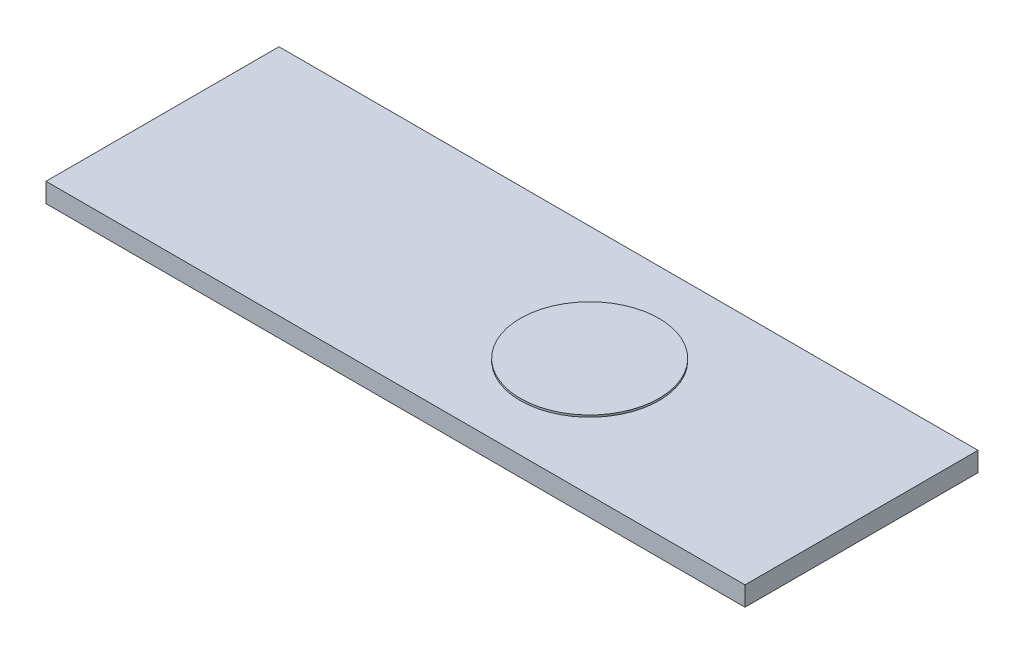
ISO-10303-21;
HEADER;
FILE_DESCRIPTION(('STEP AP214'),'2;1');
FILE_NAME('part.step','',(''),(''),'','','');
FILE_SCHEMA(('AUTOMOTIVE_DESIGN { 1 0 10303 214 1 1 1 1 }'));
ENDSEC;
DATA;
#1=APPLICATION_CONTEXT('core data for automotive mechanical design processes');
#2=APPLICATION_PROTOCOL_DEFINITION('international standard','automotive_design',2000,#1);
#3=PRODUCT_CONTEXT('',#1,'mechanical');
#4=PRODUCT('Part','Part','',(#3));
#5=PRODUCT_RELATED_PRODUCT_CATEGORY('part','',(#4));
#6=PRODUCT_DEFINITION_FORMATION('','',#4);
#7=PRODUCT_DEFINITION_CONTEXT('part definition',#1,'design');
#8=PRODUCT_DEFINITION('design','',#6,#7);
#9=PRODUCT_DEFINITION_SHAPE('','',#8);
#10=(LENGTH_UNIT() NAMED_UNIT(*) SI_UNIT(.MILLI.,.METRE.));
#11=(NAMED_UNIT(*) PLANE_ANGLE_UNIT() SI_UNIT($,.RADIAN.));
#12=(NAMED_UNIT(*) SI_UNIT($,.STERADIAN.) SOLID_ANGLE_UNIT());
#13=UNCERTAINTY_MEASURE_WITH_UNIT(LENGTH_MEASURE(1.E-05),#10,'distance_accuracy_value','');
#14=(GEOMETRIC_REPRESENTATION_CONTEXT(3) GLOBAL_UNCERTAINTY_ASSIGNED_CONTEXT((#13)) GLOBAL_UNIT_ASSIGNED_CONTEXT((#10,
#11,#12)) REPRESENTATION_CONTEXT('',''));
#15=CARTESIAN_POINT('',(0.,0.,0.));
#16=DIRECTION('',(0.,0.,1.));
#17=DIRECTION('',(1.,0.,0.));
#18=AXIS2_PLACEMENT_3D('',#15,#16,#17);
#19=CARTESIAN_POINT('',(-18.,1.,6.));
#20=DIRECTION('',(1.,0.,0.));
#21=DIRECTION('',(0.,0.,-1.));
#22=AXIS2_PLACEMENT_3D('',#19,#20,#21);
#23=PLANE('',#22);
#24=DIRECTION('',(0.,0.,1.));
#25=VECTOR('',#24,1.);
#26=CARTESIAN_POINT('',(-18.,0.,6.));
#27=LINE('',#26,#25);
#28=CARTESIAN_POINT('',(-18.,0.,-6.));
#29=VERTEX_POINT('',#28);
#30=CARTESIAN_POINT('',(-18.,0.,6.));
#31=VERTEX_POINT('',#30);
#32=EDGE_CURVE('E116',#29,#31,#27,.T.);
#33=ORIENTED_EDGE('',*,*,#32,.T.);
#34=DIRECTION('',(0.,-1.,0.));
#35=VECTOR('',#34,1.);
#36=CARTESIAN_POINT('',(-18.,1.,6.));
#37=LINE('',#36,#35);
#38=CARTESIAN_POINT('',(-18.,1.,6.));
#39=VERTEX_POINT('',#38);
#40=EDGE_CURVE('E48',#39,#31,#37,.T.);
#41=ORIENTED_EDGE('',*,*,#40,.F.);
#42=DIRECTION('',(0.,0.,1.));
#43=VECTOR('',#42,1.);
#44=CARTESIAN_POINT('',(-18.,1.,6.));
#45=LINE('',#44,#43);
#46=CARTESIAN_POINT('',(-18.,1.,-6.));
#47=VERTEX_POINT('',#46);
#48=EDGE_CURVE('E99',#47,#39,#45,.T.);
#49=ORIENTED_EDGE('',*,*,#48,.F.);
#50=DIRECTION('',(0.,-1.,0.));
#51=VECTOR('',#50,1.);
#52=CARTESIAN_POINT('',(-18.,1.,-6.));
#53=LINE('',#52,#51);
#54=EDGE_CURVE('E112',#47,#29,#53,.T.);
#55=ORIENTED_EDGE('',*,*,#54,.T.);
#56=EDGE_LOOP('',(#33,#41,#49,#55));
#57=FACE_BOUND('',#56,.T.);
#58=ADVANCED_FACE('F45',(#57),#23,.F.);
#59=CARTESIAN_POINT('',(18.,1.,6.));
#60=DIRECTION('',(0.,0.,-1.));
#61=DIRECTION('',(-1.,0.,0.));
#62=AXIS2_PLACEMENT_3D('',#59,#60,#61);
#63=PLANE('',#62);
#64=DIRECTION('',(1.,0.,0.));
#65=VECTOR('',#64,1.);
#66=CARTESIAN_POINT('',(18.,0.,6.));
#67=LINE('',#66,#65);
#68=CARTESIAN_POINT('',(18.,0.,6.));
#69=VERTEX_POINT('',#68);
#70=EDGE_CURVE('E105',#31,#69,#67,.T.);
#71=ORIENTED_EDGE('',*,*,#70,.T.);
#72=DIRECTION('',(0.,-1.,0.));
#73=VECTOR('',#72,1.);
#74=CARTESIAN_POINT('',(18.,1.,6.));
#75=LINE('',#74,#73);
#76=CARTESIAN_POINT('',(18.,1.,6.));
#77=VERTEX_POINT('',#76);
#78=EDGE_CURVE('E103',#77,#69,#75,.T.);
#79=ORIENTED_EDGE('',*,*,#78,.F.);
#80=DIRECTION('',(1.,0.,0.));
#81=VECTOR('',#80,1.);
#82=CARTESIAN_POINT('',(18.,1.,6.));
#83=LINE('',#82,#81);
#84=EDGE_CURVE('E94',#39,#77,#83,.T.);
#85=ORIENTED_EDGE('',*,*,#84,.F.);
#86=ORIENTED_EDGE('',*,*,#40,.T.);
#87=EDGE_LOOP('',(#71,#79,#85,#86));
#88=FACE_BOUND('',#87,.T.);
#89=ADVANCED_FACE('F104',(#88),#63,.F.);
#90=CARTESIAN_POINT('',(18.,1.,6.));
#91=DIRECTION('',(-1.,0.,0.));
#92=DIRECTION('',(0.,0.,1.));
#93=AXIS2_PLACEMENT_3D('',#90,#91,#92);
#94=PLANE('',#93);
#95=DIRECTION('',(0.,0.,-1.));
#96=VECTOR('',#95,1.);
#97=CARTESIAN_POINT('',(18.,0.,6.));
#98=LINE('',#97,#96);
#99=CARTESIAN_POINT('',(18.,0.,-6.));
#100=VERTEX_POINT('',#99);
#101=EDGE_CURVE('E80',#69,#100,#98,.T.);
#102=ORIENTED_EDGE('',*,*,#101,.T.);
#103=DIRECTION('',(0.,-1.,0.));
#104=VECTOR('',#103,1.);
#105=CARTESIAN_POINT('',(18.,1.,-6.));
#106=LINE('',#105,#104);
#107=CARTESIAN_POINT('',(18.,1.,-6.));
#108=VERTEX_POINT('',#107);
#109=EDGE_CURVE('E107',#108,#100,#106,.T.);
#110=ORIENTED_EDGE('',*,*,#109,.F.);
#111=DIRECTION('',(0.,0.,-1.));
#112=VECTOR('',#111,1.);
#113=CARTESIAN_POINT('',(18.,1.,6.));
#114=LINE('',#113,#112);
#115=EDGE_CURVE('E97',#77,#108,#114,.T.);
#116=ORIENTED_EDGE('',*,*,#115,.F.);
#117=ORIENTED_EDGE('',*,*,#78,.T.);
#118=EDGE_LOOP('',(#102,#110,#116,#117));
#119=FACE_BOUND('',#118,.T.);
#120=ADVANCED_FACE('F108',(#119),#94,.F.);
#121=CARTESIAN_POINT('',(18.,1.,-6.));
#122=DIRECTION('',(0.,0.,1.));
#123=DIRECTION('',(1.,0.,0.));
#124=AXIS2_PLACEMENT_3D('',#121,#122,#123);
#125=PLANE('',#124);
#126=DIRECTION('',(-1.,0.,0.));
#127=VECTOR('',#126,1.);
#128=CARTESIAN_POINT('',(18.,0.,-6.));
#129=LINE('',#128,#127);
#130=EDGE_CURVE('E86',#100,#29,#129,.T.);
#131=ORIENTED_EDGE('',*,*,#130,.T.);
#132=ORIENTED_EDGE('',*,*,#54,.F.);
#133=DIRECTION('',(-1.,0.,0.));
#134=VECTOR('',#133,1.);
#135=CARTESIAN_POINT('',(18.,1.,-6.));
#136=LINE('',#135,#134);
#137=EDGE_CURVE('E63',#108,#47,#136,.T.);
#138=ORIENTED_EDGE('',*,*,#137,.F.);
#139=ORIENTED_EDGE('',*,*,#109,.T.);
#140=EDGE_LOOP('',(#131,#132,#138,#139));
#141=FACE_BOUND('',#140,.T.);
#142=ADVANCED_FACE('F130',(#141),#125,.F.);
#143=CARTESIAN_POINT('',(0.,1.,0.));
#144=DIRECTION('',(0.,1.,0.));
#145=DIRECTION('',(0.,0.,1.));
#146=AXIS2_PLACEMENT_3D('',#143,#144,#145);
#147=PLANE('',#146);
#148=CARTESIAN_POINT('',(4.,1.,0.));
#149=DIRECTION('',(0.,1.,0.));
#150=DIRECTION('',(0.,0.,1.));
#151=AXIS2_PLACEMENT_3D('',#148,#149,#150);
#152=CIRCLE('',#151,3.57193064090408);
#153=CARTESIAN_POINT('',(4.,1.,3.57193064090408));
#154=VERTEX_POINT('',#153);
#155=EDGE_CURVE('E11',#154,#154,#152,.T.);
#156=ORIENTED_EDGE('',*,*,#155,.F.);
#157=EDGE_LOOP('',(#156));
#158=FACE_BOUND('',#157,.T.);
#159=ORIENTED_EDGE('',*,*,#48,.T.);
#160=ORIENTED_EDGE('',*,*,#84,.T.);
#161=ORIENTED_EDGE('',*,*,#115,.T.);
#162=ORIENTED_EDGE('',*,*,#137,.T.);
#163=EDGE_LOOP('',(#159,#160,#161,#162));
#164=FACE_BOUND('',#163,.T.);
#165=ADVANCED_FACE('F95',(#158,#164),#147,.T.);
#166=CARTESIAN_POINT('',(0.,0.,0.));
#167=DIRECTION('',(0.,1.,0.));
#168=DIRECTION('',(0.,0.,1.));
#169=AXIS2_PLACEMENT_3D('',#166,#167,#168);
#170=PLANE('',#169);
#171=ORIENTED_EDGE('',*,*,#32,.F.);
#172=ORIENTED_EDGE('',*,*,#130,.F.);
#173=ORIENTED_EDGE('',*,*,#101,.F.);
#174=ORIENTED_EDGE('',*,*,#70,.F.);
#175=EDGE_LOOP('',(#171,#172,#173,#174));
#176=FACE_BOUND('',#175,.T.);
#177=ADVANCED_FACE('F133',(#176),#170,.F.);
#178=CARTESIAN_POINT('',(4.,1.1,0.));
#179=DIRECTION('',(0.,-1.,0.));
#180=DIRECTION('',(0.,0.,-1.));
#181=AXIS2_PLACEMENT_3D('',#178,#179,#180);
#182=CYLINDRICAL_SURFACE('',#181,3.57193064090408);
#183=CARTESIAN_POINT('',(4.,1.1,0.));
#184=DIRECTION('',(0.,1.,0.));
#185=DIRECTION('',(0.,0.,1.));
#186=AXIS2_PLACEMENT_3D('',#183,#184,#185);
#187=CIRCLE('',#186,3.57193064090408);
#188=CARTESIAN_POINT('',(4.,1.1,3.57193064090408));
#189=VERTEX_POINT('',#188);
#190=EDGE_CURVE('E120',#189,#189,#187,.T.);
#191=ORIENTED_EDGE('',*,*,#190,.F.);
#192=EDGE_LOOP('',(#191));
#193=FACE_BOUND('',#192,.T.);
#194=ORIENTED_EDGE('',*,*,#155,.T.);
#195=EDGE_LOOP('',(#194));
#196=FACE_BOUND('',#195,.T.);
#197=ADVANCED_FACE('F143',(#193,#196),#182,.T.);
#198=CARTESIAN_POINT('',(4.,1.1,0.));
#199=DIRECTION('',(0.,1.,0.));
#200=DIRECTION('',(0.,0.,1.));
#201=AXIS2_PLACEMENT_3D('',#198,#199,#200);
#202=PLANE('',#201);
#203=ORIENTED_EDGE('',*,*,#190,.T.);
#204=EDGE_LOOP('',(#203));
#205=FACE_BOUND('',#204,.T.);
#206=ADVANCED_FACE('F141',(#205),#202,.T.);
#207=CLOSED_SHELL('',(#58,#89,#120,#142,#165,#177,#197,#206));
#208=MANIFOLD_SOLID_BREP('B2',#207);
#209=ADVANCED_BREP_SHAPE_REPRESENTATION('',(#18,#208),#14);
#210=SHAPE_DEFINITION_REPRESENTATION(#9,#209);
ENDSEC;
END-ISO-10303-21;
